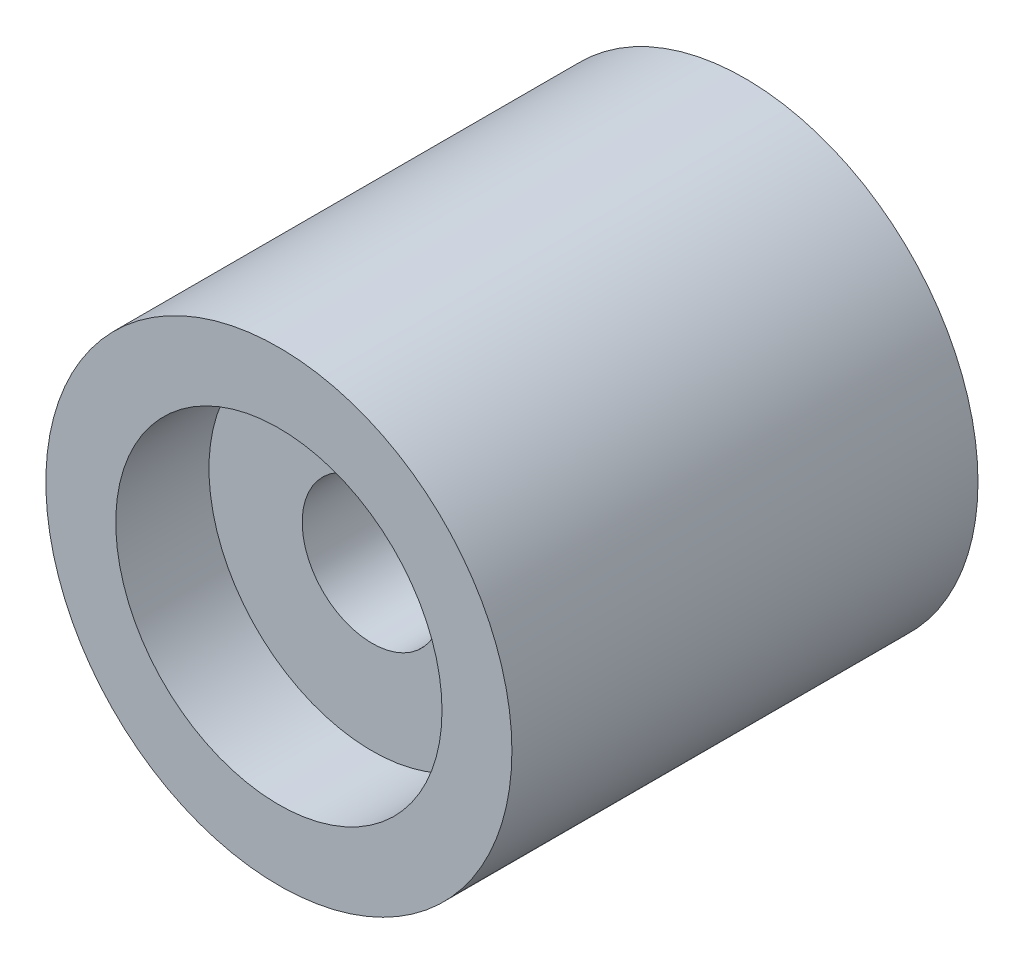
ISO-10303-21;
HEADER;
FILE_DESCRIPTION(('STEP AP214'),'2;1');
FILE_NAME('part.step','',(''),(''),'','','');
FILE_SCHEMA(('AUTOMOTIVE_DESIGN { 1 0 10303 214 1 1 1 1 }'));
ENDSEC;
DATA;
#1=APPLICATION_CONTEXT('core data for automotive mechanical design processes');
#2=APPLICATION_PROTOCOL_DEFINITION('international standard','automotive_design',2000,#1);
#3=PRODUCT_CONTEXT('',#1,'mechanical');
#4=PRODUCT('Part','Part','',(#3));
#5=PRODUCT_RELATED_PRODUCT_CATEGORY('part','',(#4));
#6=PRODUCT_DEFINITION_FORMATION('','',#4);
#7=PRODUCT_DEFINITION_CONTEXT('part definition',#1,'design');
#8=PRODUCT_DEFINITION('design','',#6,#7);
#9=PRODUCT_DEFINITION_SHAPE('','',#8);
#10=(LENGTH_UNIT() NAMED_UNIT(*) SI_UNIT(.MILLI.,.METRE.));
#11=(NAMED_UNIT(*) PLANE_ANGLE_UNIT() SI_UNIT($,.RADIAN.));
#12=(NAMED_UNIT(*) SI_UNIT($,.STERADIAN.) SOLID_ANGLE_UNIT());
#13=UNCERTAINTY_MEASURE_WITH_UNIT(LENGTH_MEASURE(1.E-05),#10,'distance_accuracy_value','');
#14=(GEOMETRIC_REPRESENTATION_CONTEXT(3) GLOBAL_UNCERTAINTY_ASSIGNED_CONTEXT((#13)) GLOBAL_UNIT_ASSIGNED_CONTEXT((#10,
#11,#12)) REPRESENTATION_CONTEXT('',''));
#15=CARTESIAN_POINT('',(0.,0.,0.));
#16=DIRECTION('',(0.,0.,1.));
#17=DIRECTION('',(1.,0.,0.));
#18=AXIS2_PLACEMENT_3D('',#15,#16,#17);
#19=CARTESIAN_POINT('',(0.,0.,10.));
#20=DIRECTION('',(0.,0.,-1.));
#21=DIRECTION('',(-1.,0.,0.));
#22=AXIS2_PLACEMENT_3D('',#19,#20,#21);
#23=CYLINDRICAL_SURFACE('',#22,5.);
#24=CARTESIAN_POINT('',(0.,0.,10.));
#25=DIRECTION('',(0.,0.,1.));
#26=DIRECTION('',(1.,0.,0.));
#27=AXIS2_PLACEMENT_3D('',#24,#25,#26);
#28=CIRCLE('',#27,5.);
#29=CARTESIAN_POINT('',(5.,0.,10.));
#30=VERTEX_POINT('',#29);
#31=EDGE_CURVE('E10',#30,#30,#28,.T.);
#32=ORIENTED_EDGE('',*,*,#31,.F.);
#33=EDGE_LOOP('',(#32));
#34=FACE_BOUND('',#33,.T.);
#35=CARTESIAN_POINT('',(0.,0.,0.));
#36=DIRECTION('',(0.,0.,1.));
#37=DIRECTION('',(1.,0.,0.));
#38=AXIS2_PLACEMENT_3D('',#35,#36,#37);
#39=CIRCLE('',#38,5.);
#40=CARTESIAN_POINT('',(5.,0.,0.));
#41=VERTEX_POINT('',#40);
#42=EDGE_CURVE('E38',#41,#41,#39,.T.);
#43=ORIENTED_EDGE('',*,*,#42,.T.);
#44=EDGE_LOOP('',(#43));
#45=FACE_BOUND('',#44,.T.);
#46=ADVANCED_FACE('F31',(#34,#45),#23,.T.);
#47=CARTESIAN_POINT('',(0.,0.,10.));
#48=DIRECTION('',(0.,0.,1.));
#49=DIRECTION('',(1.,0.,0.));
#50=AXIS2_PLACEMENT_3D('',#47,#48,#49);
#51=PLANE('',#50);
#52=CARTESIAN_POINT('',(0.,0.,10.));
#53=DIRECTION('',(0.,0.,1.));
#54=DIRECTION('',(1.,0.,0.));
#55=AXIS2_PLACEMENT_3D('',#52,#53,#54);
#56=CIRCLE('',#55,3.5);
#57=CARTESIAN_POINT('',(3.5,0.,10.));
#58=VERTEX_POINT('',#57);
#59=EDGE_CURVE('E51',#58,#58,#56,.T.);
#60=ORIENTED_EDGE('',*,*,#59,.F.);
#61=EDGE_LOOP('',(#60));
#62=FACE_BOUND('',#61,.T.);
#63=ORIENTED_EDGE('',*,*,#31,.T.);
#64=EDGE_LOOP('',(#63));
#65=FACE_BOUND('',#64,.T.);
#66=ADVANCED_FACE('F79',(#62,#65),#51,.T.);
#67=CARTESIAN_POINT('',(0.,0.,0.));
#68=DIRECTION('',(0.,0.,1.));
#69=DIRECTION('',(1.,0.,0.));
#70=AXIS2_PLACEMENT_3D('',#67,#68,#69);
#71=PLANE('',#70);
#72=CARTESIAN_POINT('',(0.,0.,0.));
#73=DIRECTION('',(0.,0.,1.));
#74=DIRECTION('',(1.,0.,0.));
#75=AXIS2_PLACEMENT_3D('',#72,#73,#74);
#76=CIRCLE('',#75,3.5);
#77=CARTESIAN_POINT('',(3.5,0.,0.));
#78=VERTEX_POINT('',#77);
#79=EDGE_CURVE('E45',#78,#78,#76,.T.);
#80=ORIENTED_EDGE('',*,*,#79,.T.);
#81=EDGE_LOOP('',(#80));
#82=FACE_BOUND('',#81,.T.);
#83=ORIENTED_EDGE('',*,*,#42,.F.);
#84=EDGE_LOOP('',(#83));
#85=FACE_BOUND('',#84,.T.);
#86=ADVANCED_FACE('F81',(#82,#85),#71,.F.);
#87=CARTESIAN_POINT('',(0.,0.,2.));
#88=DIRECTION('',(0.,0.,-1.));
#89=DIRECTION('',(-1.,0.,0.));
#90=AXIS2_PLACEMENT_3D('',#87,#88,#89);
#91=CYLINDRICAL_SURFACE('',#90,3.5);
#92=CARTESIAN_POINT('',(0.,0.,2.));
#93=DIRECTION('',(0.,0.,1.));
#94=DIRECTION('',(1.,0.,0.));
#95=AXIS2_PLACEMENT_3D('',#92,#93,#94);
#96=CIRCLE('',#95,3.5);
#97=CARTESIAN_POINT('',(3.5,0.,2.));
#98=VERTEX_POINT('',#97);
#99=EDGE_CURVE('E43',#98,#98,#96,.T.);
#100=ORIENTED_EDGE('',*,*,#99,.T.);
#101=EDGE_LOOP('',(#100));
#102=FACE_BOUND('',#101,.T.);
#103=ORIENTED_EDGE('',*,*,#79,.F.);
#104=EDGE_LOOP('',(#103));
#105=FACE_BOUND('',#104,.T.);
#106=ADVANCED_FACE('F87',(#102,#105),#91,.F.);
#107=CARTESIAN_POINT('',(0.,0.,2.));
#108=DIRECTION('',(0.,0.,1.));
#109=DIRECTION('',(1.,0.,0.));
#110=AXIS2_PLACEMENT_3D('',#107,#108,#109);
#111=PLANE('',#110);
#112=CARTESIAN_POINT('',(0.,0.,2.));
#113=DIRECTION('',(0.,0.,1.));
#114=DIRECTION('',(1.,0.,0.));
#115=AXIS2_PLACEMENT_3D('',#112,#113,#114);
#116=CIRCLE('',#115,1.5);
#117=CARTESIAN_POINT('',(1.5,0.,2.));
#118=VERTEX_POINT('',#117);
#119=EDGE_CURVE('E54',#118,#118,#116,.T.);
#120=ORIENTED_EDGE('',*,*,#119,.T.);
#121=EDGE_LOOP('',(#120));
#122=FACE_BOUND('',#121,.T.);
#123=ORIENTED_EDGE('',*,*,#99,.F.);
#124=EDGE_LOOP('',(#123));
#125=FACE_BOUND('',#124,.T.);
#126=ADVANCED_FACE('F75',(#122,#125),#111,.F.);
#127=CARTESIAN_POINT('',(0.,0.,8.));
#128=DIRECTION('',(0.,0.,1.));
#129=DIRECTION('',(1.,0.,0.));
#130=AXIS2_PLACEMENT_3D('',#127,#128,#129);
#131=CYLINDRICAL_SURFACE('',#130,3.5);
#132=CARTESIAN_POINT('',(0.,0.,8.));
#133=DIRECTION('',(0.,0.,1.));
#134=DIRECTION('',(1.,0.,0.));
#135=AXIS2_PLACEMENT_3D('',#132,#133,#134);
#136=CIRCLE('',#135,3.5);
#137=CARTESIAN_POINT('',(3.5,0.,8.));
#138=VERTEX_POINT('',#137);
#139=EDGE_CURVE('E48',#138,#138,#136,.T.);
#140=ORIENTED_EDGE('',*,*,#139,.F.);
#141=EDGE_LOOP('',(#140));
#142=FACE_BOUND('',#141,.T.);
#143=ORIENTED_EDGE('',*,*,#59,.T.);
#144=EDGE_LOOP('',(#143));
#145=FACE_BOUND('',#144,.T.);
#146=ADVANCED_FACE('F69',(#142,#145),#131,.F.);
#147=CARTESIAN_POINT('',(0.,0.,8.));
#148=DIRECTION('',(0.,0.,1.));
#149=DIRECTION('',(1.,0.,0.));
#150=AXIS2_PLACEMENT_3D('',#147,#148,#149);
#151=PLANE('',#150);
#152=CARTESIAN_POINT('',(0.,0.,8.));
#153=DIRECTION('',(0.,0.,1.));
#154=DIRECTION('',(1.,0.,0.));
#155=AXIS2_PLACEMENT_3D('',#152,#153,#154);
#156=CIRCLE('',#155,1.5);
#157=CARTESIAN_POINT('',(1.5,0.,8.));
#158=VERTEX_POINT('',#157);
#159=EDGE_CURVE('E34',#158,#158,#156,.T.);
#160=ORIENTED_EDGE('',*,*,#159,.F.);
#161=EDGE_LOOP('',(#160));
#162=FACE_BOUND('',#161,.T.);
#163=ORIENTED_EDGE('',*,*,#139,.T.);
#164=EDGE_LOOP('',(#163));
#165=FACE_BOUND('',#164,.T.);
#166=ADVANCED_FACE('F66',(#162,#165),#151,.T.);
#167=CARTESIAN_POINT('',(0.,0.,-2.));
#168=DIRECTION('',(0.,0.,1.));
#169=DIRECTION('',(1.,0.,0.));
#170=AXIS2_PLACEMENT_3D('',#167,#168,#169);
#171=CYLINDRICAL_SURFACE('',#170,1.5);
#172=ORIENTED_EDGE('',*,*,#159,.T.);
#173=EDGE_LOOP('',(#172));
#174=FACE_BOUND('',#173,.T.);
#175=ORIENTED_EDGE('',*,*,#119,.F.);
#176=EDGE_LOOP('',(#175));
#177=FACE_BOUND('',#176,.T.);
#178=ADVANCED_FACE('F63',(#174,#177),#171,.F.);
#179=CLOSED_SHELL('',(#46,#66,#86,#106,#126,#146,#166,#178));
#180=MANIFOLD_SOLID_BREP('B2',#179);
#181=ADVANCED_BREP_SHAPE_REPRESENTATION('',(#18,#180),#14);
#182=SHAPE_DEFINITION_REPRESENTATION(#9,#181);
ENDSEC;
END-ISO-10303-21;
